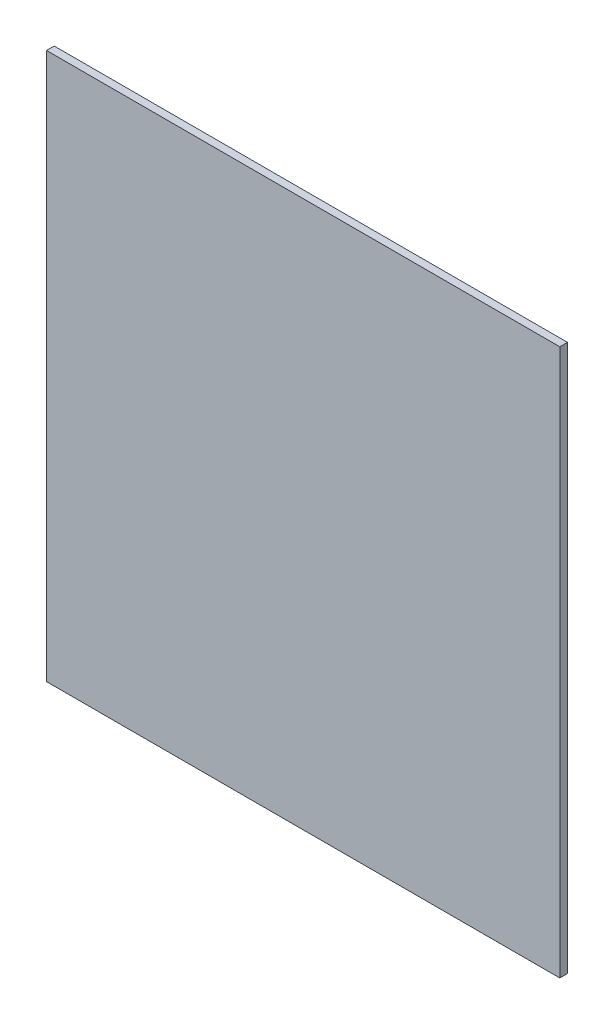
ISO-10303-21;
HEADER;
FILE_DESCRIPTION(('STEP AP214'),'2;1');
FILE_NAME('part.step','',(''),(''),'','','');
FILE_SCHEMA(('AUTOMOTIVE_DESIGN { 1 0 10303 214 1 1 1 1 }'));
ENDSEC;
DATA;
#1=APPLICATION_CONTEXT('core data for automotive mechanical design processes');
#2=APPLICATION_PROTOCOL_DEFINITION('international standard','automotive_design',2000,#1);
#3=PRODUCT_CONTEXT('',#1,'mechanical');
#4=PRODUCT('Part','Part','',(#3));
#5=PRODUCT_RELATED_PRODUCT_CATEGORY('part','',(#4));
#6=PRODUCT_DEFINITION_FORMATION('','',#4);
#7=PRODUCT_DEFINITION_CONTEXT('part definition',#1,'design');
#8=PRODUCT_DEFINITION('design','',#6,#7);
#9=PRODUCT_DEFINITION_SHAPE('','',#8);
#10=(LENGTH_UNIT() NAMED_UNIT(*) SI_UNIT(.MILLI.,.METRE.));
#11=(NAMED_UNIT(*) PLANE_ANGLE_UNIT() SI_UNIT($,.RADIAN.));
#12=(NAMED_UNIT(*) SI_UNIT($,.STERADIAN.) SOLID_ANGLE_UNIT());
#13=UNCERTAINTY_MEASURE_WITH_UNIT(LENGTH_MEASURE(1.E-05),#10,'distance_accuracy_value','');
#14=(GEOMETRIC_REPRESENTATION_CONTEXT(3) GLOBAL_UNCERTAINTY_ASSIGNED_CONTEXT((#13)) GLOBAL_UNIT_ASSIGNED_CONTEXT((#10,
#11,#12)) REPRESENTATION_CONTEXT('',''));
#15=CARTESIAN_POINT('',(0.,0.,0.));
#16=DIRECTION('',(0.,0.,1.));
#17=DIRECTION('',(1.,0.,0.));
#18=AXIS2_PLACEMENT_3D('',#15,#16,#17);
#19=CARTESIAN_POINT('',(-100.,-106.5,3.));
#20=DIRECTION('',(1.,0.,0.));
#21=DIRECTION('',(0.,1.,0.));
#22=AXIS2_PLACEMENT_3D('',#19,#20,#21);
#23=PLANE('',#22);
#24=DIRECTION('',(0.,-1.,0.));
#25=VECTOR('',#24,1.);
#26=CARTESIAN_POINT('',(-100.,-106.5,0.));
#27=LINE('',#26,#25);
#28=CARTESIAN_POINT('',(-100.,106.5,0.));
#29=VERTEX_POINT('',#28);
#30=CARTESIAN_POINT('',(-100.,-106.5,0.));
#31=VERTEX_POINT('',#30);
#32=EDGE_CURVE('E100',#29,#31,#27,.T.);
#33=ORIENTED_EDGE('',*,*,#32,.T.);
#34=DIRECTION('',(0.,0.,-1.));
#35=VECTOR('',#34,1.);
#36=CARTESIAN_POINT('',(-100.,-106.5,3.));
#37=LINE('',#36,#35);
#38=CARTESIAN_POINT('',(-100.,-106.5,3.));
#39=VERTEX_POINT('',#38);
#40=EDGE_CURVE('E11',#39,#31,#37,.T.);
#41=ORIENTED_EDGE('',*,*,#40,.F.);
#42=DIRECTION('',(0.,-1.,0.));
#43=VECTOR('',#42,1.);
#44=CARTESIAN_POINT('',(-100.,-106.5,3.));
#45=LINE('',#44,#43);
#46=CARTESIAN_POINT('',(-100.,106.5,3.));
#47=VERTEX_POINT('',#46);
#48=EDGE_CURVE('E88',#47,#39,#45,.T.);
#49=ORIENTED_EDGE('',*,*,#48,.F.);
#50=DIRECTION('',(0.,0.,-1.));
#51=VECTOR('',#50,1.);
#52=CARTESIAN_POINT('',(-100.,106.5,3.));
#53=LINE('',#52,#51);
#54=EDGE_CURVE('E96',#47,#29,#53,.T.);
#55=ORIENTED_EDGE('',*,*,#54,.T.);
#56=EDGE_LOOP('',(#33,#41,#49,#55));
#57=FACE_BOUND('',#56,.T.);
#58=ADVANCED_FACE('F37',(#57),#23,.F.);
#59=CARTESIAN_POINT('',(-100.,-106.5,3.));
#60=DIRECTION('',(0.,1.,0.));
#61=DIRECTION('',(0.,0.,1.));
#62=AXIS2_PLACEMENT_3D('',#59,#60,#61);
#63=PLANE('',#62);
#64=DIRECTION('',(1.,0.,0.));
#65=VECTOR('',#64,1.);
#66=CARTESIAN_POINT('',(-100.,-106.5,0.));
#67=LINE('',#66,#65);
#68=CARTESIAN_POINT('',(100.,-106.5,0.));
#69=VERTEX_POINT('',#68);
#70=EDGE_CURVE('E92',#31,#69,#67,.T.);
#71=ORIENTED_EDGE('',*,*,#70,.T.);
#72=DIRECTION('',(0.,0.,-1.));
#73=VECTOR('',#72,1.);
#74=CARTESIAN_POINT('',(100.,-106.5,3.));
#75=LINE('',#74,#73);
#76=CARTESIAN_POINT('',(100.,-106.5,3.));
#77=VERTEX_POINT('',#76);
#78=EDGE_CURVE('E45',#77,#69,#75,.T.);
#79=ORIENTED_EDGE('',*,*,#78,.F.);
#80=DIRECTION('',(1.,0.,0.));
#81=VECTOR('',#80,1.);
#82=CARTESIAN_POINT('',(-100.,-106.5,3.));
#83=LINE('',#82,#81);
#84=EDGE_CURVE('E83',#39,#77,#83,.T.);
#85=ORIENTED_EDGE('',*,*,#84,.F.);
#86=ORIENTED_EDGE('',*,*,#40,.T.);
#87=EDGE_LOOP('',(#71,#79,#85,#86));
#88=FACE_BOUND('',#87,.T.);
#89=ADVANCED_FACE('F91',(#88),#63,.F.);
#90=CARTESIAN_POINT('',(100.,-106.5,3.));
#91=DIRECTION('',(-1.,0.,0.));
#92=DIRECTION('',(0.,-1.,0.));
#93=AXIS2_PLACEMENT_3D('',#90,#91,#92);
#94=PLANE('',#93);
#95=DIRECTION('',(0.,1.,0.));
#96=VECTOR('',#95,1.);
#97=CARTESIAN_POINT('',(100.,-106.5,0.));
#98=LINE('',#97,#96);
#99=CARTESIAN_POINT('',(100.,106.5,0.));
#100=VERTEX_POINT('',#99);
#101=EDGE_CURVE('E70',#69,#100,#98,.T.);
#102=ORIENTED_EDGE('',*,*,#101,.T.);
#103=DIRECTION('',(0.,0.,-1.));
#104=VECTOR('',#103,1.);
#105=CARTESIAN_POINT('',(100.,106.5,3.));
#106=LINE('',#105,#104);
#107=CARTESIAN_POINT('',(100.,106.5,3.));
#108=VERTEX_POINT('',#107);
#109=EDGE_CURVE('E93',#108,#100,#106,.T.);
#110=ORIENTED_EDGE('',*,*,#109,.F.);
#111=DIRECTION('',(0.,1.,0.));
#112=VECTOR('',#111,1.);
#113=CARTESIAN_POINT('',(100.,-106.5,3.));
#114=LINE('',#113,#112);
#115=EDGE_CURVE('E86',#77,#108,#114,.T.);
#116=ORIENTED_EDGE('',*,*,#115,.F.);
#117=ORIENTED_EDGE('',*,*,#78,.T.);
#118=EDGE_LOOP('',(#102,#110,#116,#117));
#119=FACE_BOUND('',#118,.T.);
#120=ADVANCED_FACE('F94',(#119),#94,.F.);
#121=CARTESIAN_POINT('',(-100.,106.5,3.));
#122=DIRECTION('',(0.,-1.,0.));
#123=DIRECTION('',(0.,0.,-1.));
#124=AXIS2_PLACEMENT_3D('',#121,#122,#123);
#125=PLANE('',#124);
#126=DIRECTION('',(-1.,0.,0.));
#127=VECTOR('',#126,1.);
#128=CARTESIAN_POINT('',(-100.,106.5,0.));
#129=LINE('',#128,#127);
#130=EDGE_CURVE('E76',#100,#29,#129,.T.);
#131=ORIENTED_EDGE('',*,*,#130,.T.);
#132=ORIENTED_EDGE('',*,*,#54,.F.);
#133=DIRECTION('',(-1.,0.,0.));
#134=VECTOR('',#133,1.);
#135=CARTESIAN_POINT('',(-100.,106.5,3.));
#136=LINE('',#135,#134);
#137=EDGE_CURVE('E53',#108,#47,#136,.T.);
#138=ORIENTED_EDGE('',*,*,#137,.F.);
#139=ORIENTED_EDGE('',*,*,#109,.T.);
#140=EDGE_LOOP('',(#131,#132,#138,#139));
#141=FACE_BOUND('',#140,.T.);
#142=ADVANCED_FACE('F107',(#141),#125,.F.);
#143=CARTESIAN_POINT('',(0.,0.,3.));
#144=DIRECTION('',(0.,0.,-1.));
#145=DIRECTION('',(-1.,0.,0.));
#146=AXIS2_PLACEMENT_3D('',#143,#144,#145);
#147=PLANE('',#146);
#148=ORIENTED_EDGE('',*,*,#48,.T.);
#149=ORIENTED_EDGE('',*,*,#84,.T.);
#150=ORIENTED_EDGE('',*,*,#115,.T.);
#151=ORIENTED_EDGE('',*,*,#137,.T.);
#152=EDGE_LOOP('',(#148,#149,#150,#151));
#153=FACE_BOUND('',#152,.T.);
#154=ADVANCED_FACE('F84',(#153),#147,.F.);
#155=CARTESIAN_POINT('',(0.,0.,0.));
#156=DIRECTION('',(0.,0.,-1.));
#157=DIRECTION('',(-1.,0.,0.));
#158=AXIS2_PLACEMENT_3D('',#155,#156,#157);
#159=PLANE('',#158);
#160=ORIENTED_EDGE('',*,*,#32,.F.);
#161=ORIENTED_EDGE('',*,*,#130,.F.);
#162=ORIENTED_EDGE('',*,*,#101,.F.);
#163=ORIENTED_EDGE('',*,*,#70,.F.);
#164=EDGE_LOOP('',(#160,#161,#162,#163));
#165=FACE_BOUND('',#164,.T.);
#166=ADVANCED_FACE('F110',(#165),#159,.T.);
#167=CLOSED_SHELL('',(#58,#89,#120,#142,#154,#166));
#168=MANIFOLD_SOLID_BREP('B2',#167);
#169=ADVANCED_BREP_SHAPE_REPRESENTATION('',(#18,#168),#14);
#170=SHAPE_DEFINITION_REPRESENTATION(#9,#169);
ENDSEC;
END-ISO-10303-21;
